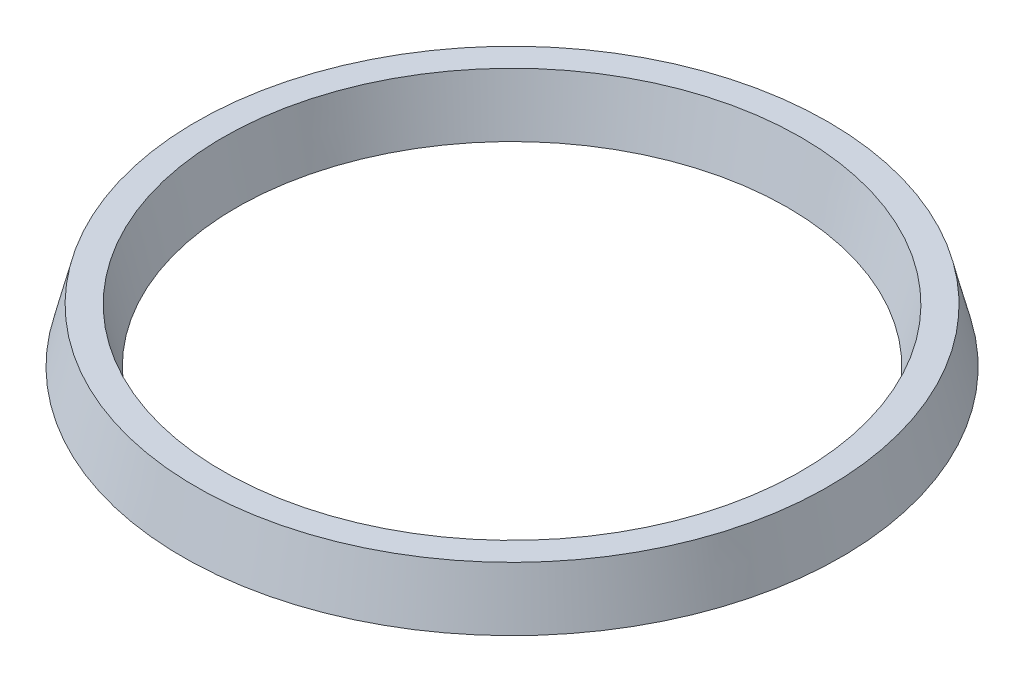
ISO-10303-21;
HEADER;
FILE_DESCRIPTION(('STEP AP214'),'2;1');
FILE_NAME('part.step','',(''),(''),'','','');
FILE_SCHEMA(('AUTOMOTIVE_DESIGN { 1 0 10303 214 1 1 1 1 }'));
ENDSEC;
DATA;
#1=APPLICATION_CONTEXT('core data for automotive mechanical design processes');
#2=APPLICATION_PROTOCOL_DEFINITION('international standard','automotive_design',2000,#1);
#3=PRODUCT_CONTEXT('',#1,'mechanical');
#4=PRODUCT('Part','Part','',(#3));
#5=PRODUCT_RELATED_PRODUCT_CATEGORY('part','',(#4));
#6=PRODUCT_DEFINITION_FORMATION('','',#4);
#7=PRODUCT_DEFINITION_CONTEXT('part definition',#1,'design');
#8=PRODUCT_DEFINITION('design','',#6,#7);
#9=PRODUCT_DEFINITION_SHAPE('','',#8);
#10=(LENGTH_UNIT() NAMED_UNIT(*) SI_UNIT(.MILLI.,.METRE.));
#11=(NAMED_UNIT(*) PLANE_ANGLE_UNIT() SI_UNIT($,.RADIAN.));
#12=(NAMED_UNIT(*) SI_UNIT($,.STERADIAN.) SOLID_ANGLE_UNIT());
#13=UNCERTAINTY_MEASURE_WITH_UNIT(LENGTH_MEASURE(1.E-05),#10,'distance_accuracy_value','');
#14=(GEOMETRIC_REPRESENTATION_CONTEXT(3) GLOBAL_UNCERTAINTY_ASSIGNED_CONTEXT((#13)) GLOBAL_UNIT_ASSIGNED_CONTEXT((#10,
#11,#12)) REPRESENTATION_CONTEXT('',''));
#15=CARTESIAN_POINT('',(0.,0.,0.));
#16=DIRECTION('',(0.,0.,1.));
#17=DIRECTION('',(1.,0.,0.));
#18=AXIS2_PLACEMENT_3D('',#15,#16,#17);
#19=CARTESIAN_POINT('',(-67.31,-6.,0.));
#20=DIRECTION('',(0.,-1.,0.));
#21=DIRECTION('',(0.,0.,-1.));
#22=AXIS2_PLACEMENT_3D('',#19,#20,#21);
#23=CONICAL_SURFACE('',#22,73.31,0.244978663126864);
#24=CARTESIAN_POINT('',(-67.31,6.,0.));
#25=DIRECTION('',(0.,-1.,0.));
#26=DIRECTION('',(0.,0.,-1.));
#27=AXIS2_PLACEMENT_3D('',#24,#25,#26);
#28=CIRCLE('',#27,70.31);
#29=CARTESIAN_POINT('',(-67.31,6.,-70.31));
#30=VERTEX_POINT('',#29);
#31=EDGE_CURVE('E76',#30,#30,#28,.T.);
#32=ORIENTED_EDGE('',*,*,#31,.T.);
#33=EDGE_LOOP('',(#32));
#34=FACE_BOUND('',#33,.T.);
#35=CARTESIAN_POINT('',(-67.31,-6.,0.));
#36=DIRECTION('',(0.,-1.,0.));
#37=DIRECTION('',(0.,0.,-1.));
#38=AXIS2_PLACEMENT_3D('',#35,#36,#37);
#39=CIRCLE('',#38,73.31);
#40=CARTESIAN_POINT('',(-67.31,-6.,-73.31));
#41=VERTEX_POINT('',#40);
#42=EDGE_CURVE('E10',#41,#41,#39,.T.);
#43=ORIENTED_EDGE('',*,*,#42,.F.);
#44=EDGE_LOOP('',(#43));
#45=FACE_BOUND('',#44,.T.);
#46=ADVANCED_FACE('F41',(#34,#45),#23,.T.);
#47=CARTESIAN_POINT('',(3.,-6.,0.));
#48=DIRECTION('',(0.,-1.,0.));
#49=DIRECTION('',(0.,0.,-1.));
#50=AXIS2_PLACEMENT_3D('',#47,#48,#49);
#51=PLANE('',#50);
#52=ORIENTED_EDGE('',*,*,#42,.T.);
#53=EDGE_LOOP('',(#52));
#54=FACE_BOUND('',#53,.T.);
#55=CARTESIAN_POINT('',(-67.31,-6.,0.));
#56=DIRECTION('',(0.,-1.,0.));
#57=DIRECTION('',(0.,0.,-1.));
#58=AXIS2_PLACEMENT_3D('',#55,#56,#57);
#59=CIRCLE('',#58,70.31);
#60=CARTESIAN_POINT('',(-67.31,-6.,-70.31));
#61=VERTEX_POINT('',#60);
#62=EDGE_CURVE('E48',#61,#61,#59,.T.);
#63=ORIENTED_EDGE('',*,*,#62,.F.);
#64=EDGE_LOOP('',(#63));
#65=FACE_BOUND('',#64,.T.);
#66=ADVANCED_FACE('F95',(#54,#65),#51,.T.);
#67=CARTESIAN_POINT('',(-67.31,-1.455213750218,0.));
#68=DIRECTION('',(0.,-1.,0.));
#69=DIRECTION('',(0.,0.,-1.));
#70=AXIS2_PLACEMENT_3D('',#67,#68,#69);
#71=CONICAL_SURFACE('',#70,69.1738034375545,0.244978663126864);
#72=ORIENTED_EDGE('',*,*,#62,.T.);
#73=EDGE_LOOP('',(#72));
#74=FACE_BOUND('',#73,.T.);
#75=CARTESIAN_POINT('',(-67.31,-1.455213750218,0.));
#76=DIRECTION('',(0.,-1.,0.));
#77=DIRECTION('',(0.,0.,-1.));
#78=AXIS2_PLACEMENT_3D('',#75,#76,#77);
#79=CIRCLE('',#78,69.1738034375545);
#80=CARTESIAN_POINT('',(-67.31,-1.455213750218,-69.1738034375545));
#81=VERTEX_POINT('',#80);
#82=EDGE_CURVE('E53',#81,#81,#79,.T.);
#83=ORIENTED_EDGE('',*,*,#82,.F.);
#84=EDGE_LOOP('',(#83));
#85=FACE_BOUND('',#84,.T.);
#86=ADVANCED_FACE('F99',(#74,#85),#71,.F.);
#87=CARTESIAN_POINT('',(-67.31,-1.92116460960662,0.));
#88=DIRECTION('',(0.,-1.,0.));
#89=DIRECTION('',(0.,0.,-1.));
#90=AXIS2_PLACEMENT_3D('',#87,#88,#89);
#91=TOROIDAL_SURFACE('',#90,67.31,1.92116460960662);
#92=ORIENTED_EDGE('',*,*,#82,.T.);
#93=EDGE_LOOP('',(#92));
#94=FACE_BOUND('',#93,.T.);
#95=CARTESIAN_POINT('',(-67.31,-1.455213750218,0.));
#96=DIRECTION('',(0.,-1.,0.));
#97=DIRECTION('',(0.,0.,-1.));
#98=AXIS2_PLACEMENT_3D('',#95,#96,#97);
#99=CIRCLE('',#98,65.4461965624455);
#100=CARTESIAN_POINT('',(-67.31,-1.455213750218,-65.4461965624455));
#101=VERTEX_POINT('',#100);
#102=EDGE_CURVE('E58',#101,#101,#99,.T.);
#103=ORIENTED_EDGE('',*,*,#102,.F.);
#104=EDGE_LOOP('',(#103));
#105=FACE_BOUND('',#104,.T.);
#106=ADVANCED_FACE('F103',(#94,#105),#91,.F.);
#107=CARTESIAN_POINT('',(-67.31,-6.,0.));
#108=DIRECTION('',(0.,1.,0.));
#109=DIRECTION('',(0.,0.,1.));
#110=AXIS2_PLACEMENT_3D('',#107,#108,#109);
#111=CONICAL_SURFACE('',#110,64.31,0.244978663126864);
#112=ORIENTED_EDGE('',*,*,#102,.T.);
#113=EDGE_LOOP('',(#112));
#114=FACE_BOUND('',#113,.T.);
#115=CARTESIAN_POINT('',(-67.31,-6.,0.));
#116=DIRECTION('',(0.,-1.,0.));
#117=DIRECTION('',(0.,0.,-1.));
#118=AXIS2_PLACEMENT_3D('',#115,#116,#117);
#119=CIRCLE('',#118,64.31);
#120=CARTESIAN_POINT('',(-67.31,-6.,-64.31));
#121=VERTEX_POINT('',#120);
#122=EDGE_CURVE('E64',#121,#121,#119,.T.);
#123=ORIENTED_EDGE('',*,*,#122,.F.);
#124=EDGE_LOOP('',(#123));
#125=FACE_BOUND('',#124,.T.);
#126=ADVANCED_FACE('F109',(#114,#125),#111,.T.);
#127=CARTESIAN_POINT('',(-6.,-6.,0.));
#128=DIRECTION('',(0.,-1.,0.));
#129=DIRECTION('',(0.,0.,-1.));
#130=AXIS2_PLACEMENT_3D('',#127,#128,#129);
#131=PLANE('',#130);
#132=ORIENTED_EDGE('',*,*,#122,.T.);
#133=EDGE_LOOP('',(#132));
#134=FACE_BOUND('',#133,.T.);
#135=CARTESIAN_POINT('',(-67.31,-6.,0.));
#136=DIRECTION('',(0.,-1.,0.));
#137=DIRECTION('',(0.,0.,-1.));
#138=AXIS2_PLACEMENT_3D('',#135,#136,#137);
#139=CIRCLE('',#138,61.31);
#140=CARTESIAN_POINT('',(-67.31,-6.,-61.31));
#141=VERTEX_POINT('',#140);
#142=EDGE_CURVE('E68',#141,#141,#139,.T.);
#143=ORIENTED_EDGE('',*,*,#142,.F.);
#144=EDGE_LOOP('',(#143));
#145=FACE_BOUND('',#144,.T.);
#146=ADVANCED_FACE('F91',(#134,#145),#131,.T.);
#147=CARTESIAN_POINT('',(-67.31,6.,0.));
#148=DIRECTION('',(0.,1.,0.));
#149=DIRECTION('',(0.,0.,1.));
#150=AXIS2_PLACEMENT_3D('',#147,#148,#149);
#151=CONICAL_SURFACE('',#150,64.31,0.244978663126864);
#152=ORIENTED_EDGE('',*,*,#142,.T.);
#153=EDGE_LOOP('',(#152));
#154=FACE_BOUND('',#153,.T.);
#155=CARTESIAN_POINT('',(-67.31,6.,0.));
#156=DIRECTION('',(0.,-1.,0.));
#157=DIRECTION('',(0.,0.,-1.));
#158=AXIS2_PLACEMENT_3D('',#155,#156,#157);
#159=CIRCLE('',#158,64.31);
#160=CARTESIAN_POINT('',(-67.31,6.,-64.31));
#161=VERTEX_POINT('',#160);
#162=EDGE_CURVE('E72',#161,#161,#159,.T.);
#163=ORIENTED_EDGE('',*,*,#162,.F.);
#164=EDGE_LOOP('',(#163));
#165=FACE_BOUND('',#164,.T.);
#166=ADVANCED_FACE('F85',(#154,#165),#151,.F.);
#167=CARTESIAN_POINT('',(3.,6.,0.));
#168=DIRECTION('',(0.,1.,0.));
#169=DIRECTION('',(0.,0.,1.));
#170=AXIS2_PLACEMENT_3D('',#167,#168,#169);
#171=PLANE('',#170);
#172=ORIENTED_EDGE('',*,*,#162,.T.);
#173=EDGE_LOOP('',(#172));
#174=FACE_BOUND('',#173,.T.);
#175=ORIENTED_EDGE('',*,*,#31,.F.);
#176=EDGE_LOOP('',(#175));
#177=FACE_BOUND('',#176,.T.);
#178=ADVANCED_FACE('F83',(#174,#177),#171,.T.);
#179=CLOSED_SHELL('',(#46,#66,#86,#106,#126,#146,#166,#178));
#180=MANIFOLD_SOLID_BREP('B2',#179);
#181=ADVANCED_BREP_SHAPE_REPRESENTATION('',(#18,#180),#14);
#182=SHAPE_DEFINITION_REPRESENTATION(#9,#181);
ENDSEC;
END-ISO-10303-21;
